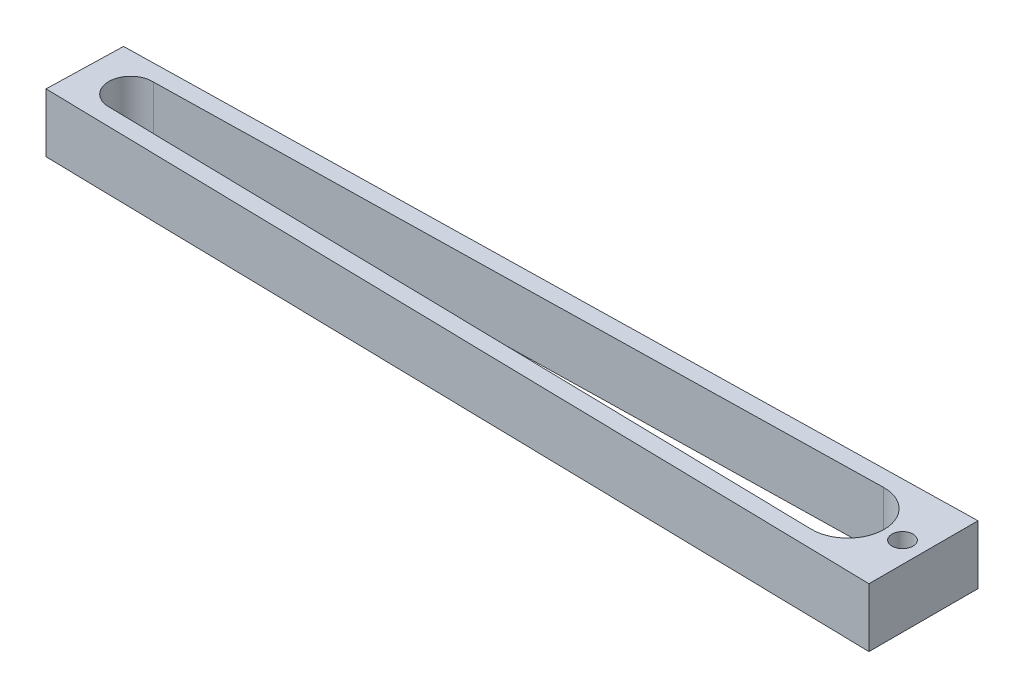
ISO-10303-21;
HEADER;
FILE_DESCRIPTION(('STEP AP214'),'2;1');
FILE_NAME('part.step','',(''),(''),'','','');
FILE_SCHEMA(('AUTOMOTIVE_DESIGN { 1 0 10303 214 1 1 1 1 }'));
ENDSEC;
DATA;
#1=APPLICATION_CONTEXT('core data for automotive mechanical design processes');
#2=APPLICATION_PROTOCOL_DEFINITION('international standard','automotive_design',2000,#1);
#3=PRODUCT_CONTEXT('',#1,'mechanical');
#4=PRODUCT('Part','Part','',(#3));
#5=PRODUCT_RELATED_PRODUCT_CATEGORY('part','',(#4));
#6=PRODUCT_DEFINITION_FORMATION('','',#4);
#7=PRODUCT_DEFINITION_CONTEXT('part definition',#1,'design');
#8=PRODUCT_DEFINITION('design','',#6,#7);
#9=PRODUCT_DEFINITION_SHAPE('','',#8);
#10=(LENGTH_UNIT() NAMED_UNIT(*) SI_UNIT(.MILLI.,.METRE.));
#11=(NAMED_UNIT(*) PLANE_ANGLE_UNIT() SI_UNIT($,.RADIAN.));
#12=(NAMED_UNIT(*) SI_UNIT($,.STERADIAN.) SOLID_ANGLE_UNIT());
#13=UNCERTAINTY_MEASURE_WITH_UNIT(LENGTH_MEASURE(1.E-05),#10,'distance_accuracy_value','');
#14=(GEOMETRIC_REPRESENTATION_CONTEXT(3) GLOBAL_UNCERTAINTY_ASSIGNED_CONTEXT((#13)) GLOBAL_UNIT_ASSIGNED_CONTEXT((#10,
#11,#12)) REPRESENTATION_CONTEXT('',''));
#15=CARTESIAN_POINT('',(0.,0.,0.));
#16=DIRECTION('',(0.,0.,1.));
#17=DIRECTION('',(1.,0.,0.));
#18=AXIS2_PLACEMENT_3D('',#15,#16,#17);
#19=CARTESIAN_POINT('',(-79.3133395632275,14.,51.0006964694896));
#20=DIRECTION('',(0.,-1.,0.));
#21=DIRECTION('',(0.,0.,-1.));
#22=AXIS2_PLACEMENT_3D('',#19,#20,#21);
#23=CYLINDRICAL_SURFACE('',#22,5.21742055504851);
#24=CARTESIAN_POINT('',(-79.3133395632275,0.,51.0006964694896));
#25=DIRECTION('',(0.,1.,0.));
#26=DIRECTION('',(0.,0.,1.));
#27=AXIS2_PLACEMENT_3D('',#24,#25,#26);
#28=CIRCLE('',#27,5.21742055504851);
#29=CARTESIAN_POINT('',(-79.1121880341873,0.,45.7871549370371));
#30=VERTEX_POINT('',#29);
#31=CARTESIAN_POINT('',(-79.4193261468922,0.,56.2170404087181));
#32=VERTEX_POINT('',#31);
#33=EDGE_CURVE('E145',#30,#32,#28,.T.);
#34=ORIENTED_EDGE('',*,*,#33,.F.);
#35=DIRECTION('',(0.,-1.,0.));
#36=VECTOR('',#35,1.);
#37=CARTESIAN_POINT('',(-79.1121880341873,14.,45.7871549370371));
#38=LINE('',#37,#36);
#39=CARTESIAN_POINT('',(-79.1121880341873,14.,45.7871549370371));
#40=VERTEX_POINT('',#39);
#41=EDGE_CURVE('E11',#40,#30,#38,.T.);
#42=ORIENTED_EDGE('',*,*,#41,.F.);
#43=CARTESIAN_POINT('',(-79.3133395632275,14.,51.0006964694896));
#44=DIRECTION('',(0.,1.,0.));
#45=DIRECTION('',(0.,0.,1.));
#46=AXIS2_PLACEMENT_3D('',#43,#44,#45);
#47=CIRCLE('',#46,5.21742055504851);
#48=CARTESIAN_POINT('',(-79.4193261468922,14.,56.2170404087181));
#49=VERTEX_POINT('',#48);
#50=EDGE_CURVE('E125',#40,#49,#47,.T.);
#51=ORIENTED_EDGE('',*,*,#50,.T.);
#52=DIRECTION('',(0.,-1.,0.));
#53=VECTOR('',#52,1.);
#54=CARTESIAN_POINT('',(-79.4193261468922,14.,56.2170404087181));
#55=LINE('',#54,#53);
#56=EDGE_CURVE('E88',#49,#32,#55,.T.);
#57=ORIENTED_EDGE('',*,*,#56,.T.);
#58=EDGE_LOOP('',(#34,#42,#51,#57));
#59=FACE_BOUND('',#58,.T.);
#60=ADVANCED_FACE('F35',(#59),#23,.F.);
#61=CARTESIAN_POINT('',(0.864776803696182,14.,44.2232203461017));
#62=DIRECTION('',(0.0195510752727799,0.,0.999808859460486));
#63=DIRECTION('',(0.999808859460486,0.,-0.0195510752727799));
#64=AXIS2_PLACEMENT_3D('',#61,#62,#63);
#65=PLANE('',#64);
#66=DIRECTION('',(-0.999808859460486,0.,0.0195510752727799));
#67=VECTOR('',#66,1.);
#68=CARTESIAN_POINT('',(0.864776803696182,0.,44.2232203461017));
#69=LINE('',#68,#67);
#70=CARTESIAN_POINT('',(91.3514899692119,0.,42.4537695920445));
#71=VERTEX_POINT('',#70);
#72=EDGE_CURVE('E116',#71,#30,#69,.T.);
#73=ORIENTED_EDGE('',*,*,#72,.F.);
#74=DIRECTION('',(0.,-1.,0.));
#75=VECTOR('',#74,1.);
#76=CARTESIAN_POINT('',(91.3514899692119,14.,42.4537695920445));
#77=LINE('',#76,#75);
#78=CARTESIAN_POINT('',(91.3514899692119,14.,42.4537695920445));
#79=VERTEX_POINT('',#78);
#80=EDGE_CURVE('E45',#79,#71,#77,.T.);
#81=ORIENTED_EDGE('',*,*,#80,.F.);
#82=DIRECTION('',(-0.999808859460486,0.,0.0195510752727799));
#83=VECTOR('',#82,1.);
#84=CARTESIAN_POINT('',(0.864776803696182,14.,44.2232203461017));
#85=LINE('',#84,#83);
#86=EDGE_CURVE('E114',#79,#40,#85,.T.);
#87=ORIENTED_EDGE('',*,*,#86,.T.);
#88=ORIENTED_EDGE('',*,*,#41,.T.);
#89=EDGE_LOOP('',(#73,#81,#87,#88));
#90=FACE_BOUND('',#89,.T.);
#91=ADVANCED_FACE('F113',(#90),#65,.T.);
#92=CARTESIAN_POINT('',(91.5199777411344,14.,51.0699487396651));
#93=DIRECTION('',(0.,-1.,0.));
#94=DIRECTION('',(0.,0.,-1.));
#95=AXIS2_PLACEMENT_3D('',#92,#93,#94);
#96=CYLINDRICAL_SURFACE('',#95,8.61782636360118);
#97=CARTESIAN_POINT('',(91.5199777411344,0.,51.0699487396651));
#98=DIRECTION('',(0.,1.,0.));
#99=DIRECTION('',(0.,0.,1.));
#100=AXIS2_PLACEMENT_3D('',#97,#98,#99);
#101=CIRCLE('',#100,8.61782636360118);
#102=CARTESIAN_POINT('',(91.3445043864516,0.,59.685988452606));
#103=VERTEX_POINT('',#102);
#104=EDGE_CURVE('E149',#103,#71,#101,.T.);
#105=ORIENTED_EDGE('',*,*,#104,.F.);
#106=DIRECTION('',(0.,-1.,0.));
#107=VECTOR('',#106,1.);
#108=CARTESIAN_POINT('',(91.3445043864516,14.,59.685988452606));
#109=LINE('',#108,#107);
#110=CARTESIAN_POINT('',(91.3445043864516,14.,59.685988452606));
#111=VERTEX_POINT('',#110);
#112=EDGE_CURVE('E81',#111,#103,#109,.T.);
#113=ORIENTED_EDGE('',*,*,#112,.F.);
#114=CARTESIAN_POINT('',(91.5199777411344,14.,51.0699487396651));
#115=DIRECTION('',(0.,1.,0.));
#116=DIRECTION('',(0.,0.,1.));
#117=AXIS2_PLACEMENT_3D('',#114,#115,#116);
#118=CIRCLE('',#117,8.61782636360118);
#119=EDGE_CURVE('E124',#111,#79,#118,.T.);
#120=ORIENTED_EDGE('',*,*,#119,.T.);
#121=ORIENTED_EDGE('',*,*,#80,.T.);
#122=EDGE_LOOP('',(#105,#113,#120,#121));
#123=FACE_BOUND('',#122,.T.);
#124=ADVANCED_FACE('F127',(#123),#96,.F.);
#125=CARTESIAN_POINT('',(0.786572502605062,14.,40.2239849082597));
#126=DIRECTION('',(0.0195510752727799,0.,0.999808859460486));
#127=DIRECTION('',(0.999808859460486,0.,-0.0195510752727799));
#128=AXIS2_PLACEMENT_3D('',#125,#126,#127);
#129=PLANE('',#128);
#130=DIRECTION('',(-0.999808859460486,0.,0.0195510752727799));
#131=VECTOR('',#130,1.);
#132=CARTESIAN_POINT('',(0.786572502605062,0.,40.2239849082597));
#133=LINE('',#132,#131);
#134=CARTESIAN_POINT('',(109.519977741134,0.,38.0977235030234));
#135=VERTEX_POINT('',#134);
#136=CARTESIAN_POINT('',(-90.0051032092329,0.,41.9993991478793));
#137=VERTEX_POINT('',#136);
#138=EDGE_CURVE('E136',#135,#137,#133,.T.);
#139=ORIENTED_EDGE('',*,*,#138,.T.);
#140=DIRECTION('',(0.,-1.,0.));
#141=VECTOR('',#140,1.);
#142=CARTESIAN_POINT('',(-90.0051032092329,14.,41.9993991478793));
#143=LINE('',#142,#141);
#144=CARTESIAN_POINT('',(-90.0051032092329,14.,41.9993991478793));
#145=VERTEX_POINT('',#144);
#146=EDGE_CURVE('E39',#145,#137,#143,.T.);
#147=ORIENTED_EDGE('',*,*,#146,.F.);
#148=DIRECTION('',(-0.999808859460486,0.,0.0195510752727799));
#149=VECTOR('',#148,1.);
#150=CARTESIAN_POINT('',(0.786572502605062,14.,40.2239849082597));
#151=LINE('',#150,#149);
#152=CARTESIAN_POINT('',(109.519977741134,14.,38.0977235030234));
#153=VERTEX_POINT('',#152);
#154=EDGE_CURVE('E156',#153,#145,#151,.T.);
#155=ORIENTED_EDGE('',*,*,#154,.F.);
#156=DIRECTION('',(0.,-1.,0.));
#157=VECTOR('',#156,1.);
#158=CARTESIAN_POINT('',(109.519977741134,14.,38.0977235030234));
#159=LINE('',#158,#157);
#160=EDGE_CURVE('E135',#153,#135,#159,.T.);
#161=ORIENTED_EDGE('',*,*,#160,.T.);
#162=EDGE_LOOP('',(#139,#147,#155,#161));
#163=FACE_BOUND('',#162,.T.);
#164=ADVANCED_FACE('F37',(#163),#129,.F.);
#165=CARTESIAN_POINT('',(-88.8347045809716,14.,-2.34466588283152));
#166=DIRECTION('',(0.999651871341947,0.,0.0263843916462599));
#167=DIRECTION('',(0.0263843916462599,0.,-0.999651871341947));
#168=AXIS2_PLACEMENT_3D('',#165,#166,#167);
#169=PLANE('',#168);
#170=DIRECTION('',(-0.0263843916462599,0.,0.999651871341947));
#171=VECTOR('',#170,1.);
#172=CARTESIAN_POINT('',(-88.8347045809716,0.,-2.34466588283152));
#173=LINE('',#172,#171);
#174=CARTESIAN_POINT('',(-90.4800222588656,0.,59.9931328320344));
#175=VERTEX_POINT('',#174);
#176=EDGE_CURVE('E139',#137,#175,#173,.T.);
#177=ORIENTED_EDGE('',*,*,#176,.T.);
#178=DIRECTION('',(0.,-1.,0.));
#179=VECTOR('',#178,1.);
#180=CARTESIAN_POINT('',(-90.4800222588656,14.,59.9931328320344));
#181=LINE('',#180,#179);
#182=CARTESIAN_POINT('',(-90.4800222588656,14.,59.9931328320344));
#183=VERTEX_POINT('',#182);
#184=EDGE_CURVE('E163',#183,#175,#181,.T.);
#185=ORIENTED_EDGE('',*,*,#184,.F.);
#186=DIRECTION('',(-0.0263843916462599,0.,0.999651871341947));
#187=VECTOR('',#186,1.);
#188=CARTESIAN_POINT('',(-88.8347045809716,14.,-2.34466588283152));
#189=LINE('',#188,#187);
#190=EDGE_CURVE('E96',#145,#183,#189,.T.);
#191=ORIENTED_EDGE('',*,*,#190,.F.);
#192=ORIENTED_EDGE('',*,*,#146,.T.);
#193=EDGE_LOOP('',(#177,#185,#191,#192));
#194=FACE_BOUND('',#193,.T.);
#195=ADVANCED_FACE('F169',(#194),#169,.F.);
#196=CARTESIAN_POINT('',(-1.25578519073498,14.,61.8060064034692));
#197=DIRECTION('',(0.0203139813144181,0.,-0.999793649791374));
#198=DIRECTION('',(-0.999793649791374,0.,-0.0203139813144181));
#199=AXIS2_PLACEMENT_3D('',#196,#197,#198);
#200=PLANE('',#199);
#201=DIRECTION('',(0.999793649791375,0.,0.0203139813144181));
#202=VECTOR('',#201,1.);
#203=CARTESIAN_POINT('',(-1.25578519073498,0.,61.8060064034692));
#204=LINE('',#203,#202);
#205=CARTESIAN_POINT('',(109.519977741134,0.,64.0567676268057));
#206=VERTEX_POINT('',#205);
#207=EDGE_CURVE('E141',#175,#206,#204,.T.);
#208=ORIENTED_EDGE('',*,*,#207,.T.);
#209=DIRECTION('',(0.,-1.,0.));
#210=VECTOR('',#209,1.);
#211=CARTESIAN_POINT('',(109.519977741134,14.,64.0567676268057));
#212=LINE('',#211,#210);
#213=CARTESIAN_POINT('',(109.519977741134,14.,64.0567676268057));
#214=VERTEX_POINT('',#213);
#215=EDGE_CURVE('E161',#214,#206,#212,.T.);
#216=ORIENTED_EDGE('',*,*,#215,.F.);
#217=DIRECTION('',(0.999793649791375,0.,0.0203139813144181));
#218=VECTOR('',#217,1.);
#219=CARTESIAN_POINT('',(-1.25578519073498,14.,61.8060064034692));
#220=LINE('',#219,#218);
#221=EDGE_CURVE('E185',#183,#214,#220,.T.);
#222=ORIENTED_EDGE('',*,*,#221,.F.);
#223=ORIENTED_EDGE('',*,*,#184,.T.);
#224=EDGE_LOOP('',(#208,#216,#222,#223));
#225=FACE_BOUND('',#224,.T.);
#226=ADVANCED_FACE('F179',(#225),#200,.F.);
#227=CARTESIAN_POINT('',(-1.17429938621455,14.,57.8065335213853));
#228=DIRECTION('',(-0.0203101118521833,0.,0.99979372840429));
#229=DIRECTION('',(0.99979372840429,0.,0.0203101118521833));
#230=AXIS2_PLACEMENT_3D('',#227,#228,#229);
#231=PLANE('',#230);
#232=DIRECTION('',(-0.99979372840429,0.,-0.0203101118521833));
#233=VECTOR('',#232,1.);
#234=CARTESIAN_POINT('',(-1.17429938621455,0.,57.8065335213853));
#235=LINE('',#234,#233);
#236=EDGE_CURVE('E151',#103,#32,#235,.T.);
#237=ORIENTED_EDGE('',*,*,#236,.T.);
#238=ORIENTED_EDGE('',*,*,#56,.F.);
#239=DIRECTION('',(-0.99979372840429,0.,-0.0203101118521833));
#240=VECTOR('',#239,1.);
#241=CARTESIAN_POINT('',(-1.17429938621455,14.,57.8065335213853));
#242=LINE('',#241,#240);
#243=EDGE_CURVE('E54',#111,#49,#242,.T.);
#244=ORIENTED_EDGE('',*,*,#243,.F.);
#245=ORIENTED_EDGE('',*,*,#112,.T.);
#246=EDGE_LOOP('',(#237,#238,#244,#245));
#247=FACE_BOUND('',#246,.T.);
#248=ADVANCED_FACE('F210',(#247),#231,.F.);
#249=CARTESIAN_POINT('',(109.519977741134,14.,0.));
#250=DIRECTION('',(-1.,0.,0.));
#251=DIRECTION('',(0.,0.,1.));
#252=AXIS2_PLACEMENT_3D('',#249,#250,#251);
#253=PLANE('',#252);
#254=DIRECTION('',(0.,0.,-1.));
#255=VECTOR('',#254,1.);
#256=CARTESIAN_POINT('',(109.519977741134,0.,0.));
#257=LINE('',#256,#255);
#258=EDGE_CURVE('E143',#206,#135,#257,.T.);
#259=ORIENTED_EDGE('',*,*,#258,.T.);
#260=ORIENTED_EDGE('',*,*,#160,.F.);
#261=DIRECTION('',(0.,0.,-1.));
#262=VECTOR('',#261,1.);
#263=CARTESIAN_POINT('',(109.519977741134,14.,0.));
#264=LINE('',#263,#262);
#265=EDGE_CURVE('E183',#214,#153,#264,.T.);
#266=ORIENTED_EDGE('',*,*,#265,.F.);
#267=ORIENTED_EDGE('',*,*,#215,.T.);
#268=EDGE_LOOP('',(#259,#260,#266,#267));
#269=FACE_BOUND('',#268,.T.);
#270=ADVANCED_FACE('F182',(#269),#253,.F.);
#271=CARTESIAN_POINT('',(104.519977741134,14.,51.0752186690119));
#272=DIRECTION('',(0.,-1.,0.));
#273=DIRECTION('',(0.,0.,-1.));
#274=AXIS2_PLACEMENT_3D('',#271,#272,#273);
#275=CYLINDRICAL_SURFACE('',#274,2.50000000000001);
#276=CARTESIAN_POINT('',(104.519977741134,14.,51.0752186690119));
#277=DIRECTION('',(0.,1.,0.));
#278=DIRECTION('',(0.,0.,1.));
#279=AXIS2_PLACEMENT_3D('',#276,#277,#278);
#280=CIRCLE('',#279,2.50000000000001);
#281=CARTESIAN_POINT('',(104.519977741134,14.,53.5752186690119));
#282=VERTEX_POINT('',#281);
#283=EDGE_CURVE('E129',#282,#282,#280,.T.);
#284=ORIENTED_EDGE('',*,*,#283,.T.);
#285=EDGE_LOOP('',(#284));
#286=FACE_BOUND('',#285,.T.);
#287=CARTESIAN_POINT('',(104.519977741134,0.,51.0752186690119));
#288=DIRECTION('',(0.,1.,0.));
#289=DIRECTION('',(0.,0.,1.));
#290=AXIS2_PLACEMENT_3D('',#287,#288,#289);
#291=CIRCLE('',#290,2.50000000000001);
#292=CARTESIAN_POINT('',(104.519977741134,0.,53.5752186690119));
#293=VERTEX_POINT('',#292);
#294=EDGE_CURVE('E153',#293,#293,#291,.T.);
#295=ORIENTED_EDGE('',*,*,#294,.F.);
#296=EDGE_LOOP('',(#295));
#297=FACE_BOUND('',#296,.T.);
#298=ADVANCED_FACE('F191',(#286,#297),#275,.F.);
#299=CARTESIAN_POINT('',(0.,14.,0.));
#300=DIRECTION('',(0.,1.,0.));
#301=DIRECTION('',(0.,0.,1.));
#302=AXIS2_PLACEMENT_3D('',#299,#300,#301);
#303=PLANE('',#302);
#304=ORIENTED_EDGE('',*,*,#154,.T.);
#305=ORIENTED_EDGE('',*,*,#190,.T.);
#306=ORIENTED_EDGE('',*,*,#221,.T.);
#307=ORIENTED_EDGE('',*,*,#265,.T.);
#308=EDGE_LOOP('',(#304,#305,#306,#307));
#309=FACE_BOUND('',#308,.T.);
#310=ORIENTED_EDGE('',*,*,#50,.F.);
#311=ORIENTED_EDGE('',*,*,#86,.F.);
#312=ORIENTED_EDGE('',*,*,#119,.F.);
#313=ORIENTED_EDGE('',*,*,#243,.T.);
#314=EDGE_LOOP('',(#310,#311,#312,#313));
#315=FACE_BOUND('',#314,.T.);
#316=ORIENTED_EDGE('',*,*,#283,.F.);
#317=EDGE_LOOP('',(#316));
#318=FACE_BOUND('',#317,.T.);
#319=ADVANCED_FACE('F122',(#309,#315,#318),#303,.T.);
#320=CARTESIAN_POINT('',(0.,0.,0.));
#321=DIRECTION('',(0.,1.,0.));
#322=DIRECTION('',(0.,0.,1.));
#323=AXIS2_PLACEMENT_3D('',#320,#321,#322);
#324=PLANE('',#323);
#325=ORIENTED_EDGE('',*,*,#138,.F.);
#326=ORIENTED_EDGE('',*,*,#258,.F.);
#327=ORIENTED_EDGE('',*,*,#207,.F.);
#328=ORIENTED_EDGE('',*,*,#176,.F.);
#329=EDGE_LOOP('',(#325,#326,#327,#328));
#330=FACE_BOUND('',#329,.T.);
#331=ORIENTED_EDGE('',*,*,#33,.T.);
#332=ORIENTED_EDGE('',*,*,#236,.F.);
#333=ORIENTED_EDGE('',*,*,#104,.T.);
#334=ORIENTED_EDGE('',*,*,#72,.T.);
#335=EDGE_LOOP('',(#331,#332,#333,#334));
#336=FACE_BOUND('',#335,.T.);
#337=ORIENTED_EDGE('',*,*,#294,.T.);
#338=EDGE_LOOP('',(#337));
#339=FACE_BOUND('',#338,.T.);
#340=ADVANCED_FACE('F176',(#330,#336,#339),#324,.F.);
#341=CLOSED_SHELL('',(#60,#91,#124,#164,#195,#226,#248,#270,#298,#319,#340));
#342=MANIFOLD_SOLID_BREP('B2',#341);
#343=ADVANCED_BREP_SHAPE_REPRESENTATION('',(#18,#342),#14);
#344=SHAPE_DEFINITION_REPRESENTATION(#9,#343);
ENDSEC;
END-ISO-10303-21;
